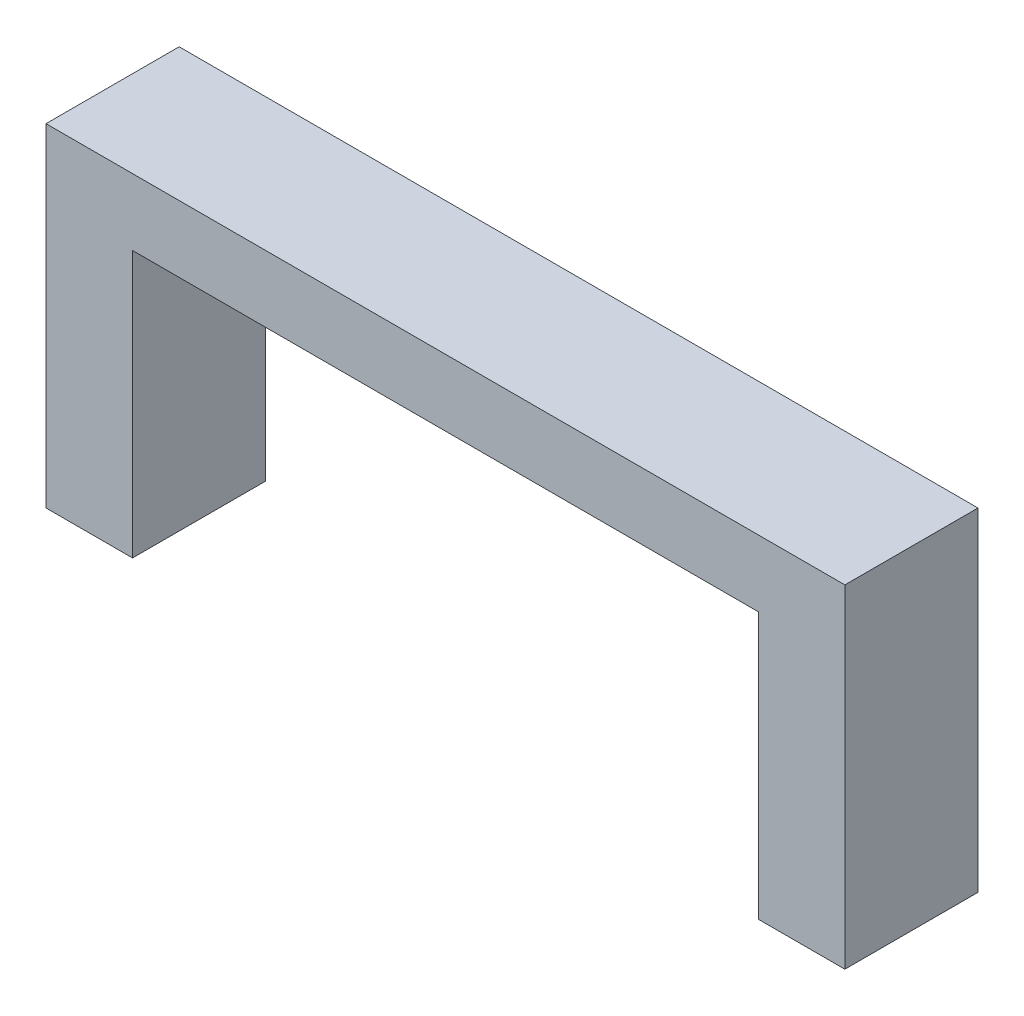
ISO-10303-21;
HEADER;
FILE_DESCRIPTION(('STEP AP214'),'2;1');
FILE_NAME('part.step','',(''),(''),'','','');
FILE_SCHEMA(('AUTOMOTIVE_DESIGN { 1 0 10303 214 1 1 1 1 }'));
ENDSEC;
DATA;
#1=APPLICATION_CONTEXT('core data for automotive mechanical design processes');
#2=APPLICATION_PROTOCOL_DEFINITION('international standard','automotive_design',2000,#1);
#3=PRODUCT_CONTEXT('',#1,'mechanical');
#4=PRODUCT('Part','Part','',(#3));
#5=PRODUCT_RELATED_PRODUCT_CATEGORY('part','',(#4));
#6=PRODUCT_DEFINITION_FORMATION('','',#4);
#7=PRODUCT_DEFINITION_CONTEXT('part definition',#1,'design');
#8=PRODUCT_DEFINITION('design','',#6,#7);
#9=PRODUCT_DEFINITION_SHAPE('','',#8);
#10=(LENGTH_UNIT() NAMED_UNIT(*) SI_UNIT(.MILLI.,.METRE.));
#11=(NAMED_UNIT(*) PLANE_ANGLE_UNIT() SI_UNIT($,.RADIAN.));
#12=(NAMED_UNIT(*) SI_UNIT($,.STERADIAN.) SOLID_ANGLE_UNIT());
#13=UNCERTAINTY_MEASURE_WITH_UNIT(LENGTH_MEASURE(1.E-05),#10,'distance_accuracy_value','');
#14=(GEOMETRIC_REPRESENTATION_CONTEXT(3) GLOBAL_UNCERTAINTY_ASSIGNED_CONTEXT((#13)) GLOBAL_UNIT_ASSIGNED_CONTEXT((#10,
#11,#12)) REPRESENTATION_CONTEXT('',''));
#15=CARTESIAN_POINT('',(0.,0.,0.));
#16=DIRECTION('',(0.,0.,1.));
#17=DIRECTION('',(1.,0.,0.));
#18=AXIS2_PLACEMENT_3D('',#15,#16,#17);
#19=CARTESIAN_POINT('',(-30.,-20.,10.));
#20=DIRECTION('',(1.,0.,0.));
#21=DIRECTION('',(0.,1.,0.));
#22=AXIS2_PLACEMENT_3D('',#19,#20,#21);
#23=PLANE('',#22);
#24=DIRECTION('',(0.,-1.,0.));
#25=VECTOR('',#24,1.);
#26=CARTESIAN_POINT('',(-30.,-20.,0.));
#27=LINE('',#26,#25);
#28=CARTESIAN_POINT('',(-30.,4.99999999999999,0.));
#29=VERTEX_POINT('',#28);
#30=CARTESIAN_POINT('',(-30.,-20.,0.));
#31=VERTEX_POINT('',#30);
#32=EDGE_CURVE('E140',#29,#31,#27,.T.);
#33=ORIENTED_EDGE('',*,*,#32,.T.);
#34=DIRECTION('',(0.,0.,-1.));
#35=VECTOR('',#34,1.);
#36=CARTESIAN_POINT('',(-30.,-20.,10.));
#37=LINE('',#36,#35);
#38=CARTESIAN_POINT('',(-30.,-20.,10.));
#39=VERTEX_POINT('',#38);
#40=EDGE_CURVE('E11',#39,#31,#37,.T.);
#41=ORIENTED_EDGE('',*,*,#40,.F.);
#42=DIRECTION('',(0.,-1.,0.));
#43=VECTOR('',#42,1.);
#44=CARTESIAN_POINT('',(-30.,-20.,10.));
#45=LINE('',#44,#43);
#46=CARTESIAN_POINT('',(-30.,4.99999999999999,10.));
#47=VERTEX_POINT('',#46);
#48=EDGE_CURVE('E162',#47,#39,#45,.T.);
#49=ORIENTED_EDGE('',*,*,#48,.F.);
#50=DIRECTION('',(0.,0.,-1.));
#51=VECTOR('',#50,1.);
#52=CARTESIAN_POINT('',(-30.,4.99999999999999,10.));
#53=LINE('',#52,#51);
#54=EDGE_CURVE('E136',#47,#29,#53,.T.);
#55=ORIENTED_EDGE('',*,*,#54,.T.);
#56=EDGE_LOOP('',(#33,#41,#49,#55));
#57=FACE_BOUND('',#56,.T.);
#58=ADVANCED_FACE('F39',(#57),#23,.F.);
#59=CARTESIAN_POINT('',(-23.5,-20.,10.));
#60=DIRECTION('',(0.,1.,0.));
#61=DIRECTION('',(-1.,0.,0.));
#62=AXIS2_PLACEMENT_3D('',#59,#60,#61);
#63=PLANE('',#62);
#64=DIRECTION('',(1.,0.,0.));
#65=VECTOR('',#64,1.);
#66=CARTESIAN_POINT('',(-23.5,-20.,0.));
#67=LINE('',#66,#65);
#68=CARTESIAN_POINT('',(-23.5,-20.,0.));
#69=VERTEX_POINT('',#68);
#70=EDGE_CURVE('E144',#31,#69,#67,.T.);
#71=ORIENTED_EDGE('',*,*,#70,.T.);
#72=DIRECTION('',(0.,0.,-1.));
#73=VECTOR('',#72,1.);
#74=CARTESIAN_POINT('',(-23.5,-20.,10.));
#75=LINE('',#74,#73);
#76=CARTESIAN_POINT('',(-23.5,-20.,10.));
#77=VERTEX_POINT('',#76);
#78=EDGE_CURVE('E48',#77,#69,#75,.T.);
#79=ORIENTED_EDGE('',*,*,#78,.F.);
#80=DIRECTION('',(1.,0.,0.));
#81=VECTOR('',#80,1.);
#82=CARTESIAN_POINT('',(-23.5,-20.,10.));
#83=LINE('',#82,#81);
#84=EDGE_CURVE('E99',#39,#77,#83,.T.);
#85=ORIENTED_EDGE('',*,*,#84,.F.);
#86=ORIENTED_EDGE('',*,*,#40,.T.);
#87=EDGE_LOOP('',(#71,#79,#85,#86));
#88=FACE_BOUND('',#87,.T.);
#89=ADVANCED_FACE('F208',(#88),#63,.F.);
#90=CARTESIAN_POINT('',(-23.5,0.,10.));
#91=DIRECTION('',(-1.,0.,0.));
#92=DIRECTION('',(0.,-1.,0.));
#93=AXIS2_PLACEMENT_3D('',#90,#91,#92);
#94=PLANE('',#93);
#95=DIRECTION('',(0.,1.,0.));
#96=VECTOR('',#95,1.);
#97=CARTESIAN_POINT('',(-23.5,0.,0.));
#98=LINE('',#97,#96);
#99=CARTESIAN_POINT('',(-23.5,0.,0.));
#100=VERTEX_POINT('',#99);
#101=EDGE_CURVE('E147',#69,#100,#98,.T.);
#102=ORIENTED_EDGE('',*,*,#101,.T.);
#103=DIRECTION('',(0.,0.,-1.));
#104=VECTOR('',#103,1.);
#105=CARTESIAN_POINT('',(-23.5,0.,10.));
#106=LINE('',#105,#104);
#107=CARTESIAN_POINT('',(-23.5,0.,10.));
#108=VERTEX_POINT('',#107);
#109=EDGE_CURVE('E173',#108,#100,#106,.T.);
#110=ORIENTED_EDGE('',*,*,#109,.F.);
#111=DIRECTION('',(0.,1.,0.));
#112=VECTOR('',#111,1.);
#113=CARTESIAN_POINT('',(-23.5,0.,10.));
#114=LINE('',#113,#112);
#115=EDGE_CURVE('E183',#77,#108,#114,.T.);
#116=ORIENTED_EDGE('',*,*,#115,.F.);
#117=ORIENTED_EDGE('',*,*,#78,.T.);
#118=EDGE_LOOP('',(#102,#110,#116,#117));
#119=FACE_BOUND('',#118,.T.);
#120=ADVANCED_FACE('F181',(#119),#94,.F.);
#121=CARTESIAN_POINT('',(23.5,0.,10.));
#122=DIRECTION('',(0.,1.,0.));
#123=DIRECTION('',(-1.,0.,0.));
#124=AXIS2_PLACEMENT_3D('',#121,#122,#123);
#125=PLANE('',#124);
#126=DIRECTION('',(1.,0.,0.));
#127=VECTOR('',#126,1.);
#128=CARTESIAN_POINT('',(23.5,0.,0.));
#129=LINE('',#128,#127);
#130=CARTESIAN_POINT('',(23.5,0.,0.));
#131=VERTEX_POINT('',#130);
#132=EDGE_CURVE('E150',#100,#131,#129,.T.);
#133=ORIENTED_EDGE('',*,*,#132,.T.);
#134=DIRECTION('',(0.,0.,-1.));
#135=VECTOR('',#134,1.);
#136=CARTESIAN_POINT('',(23.5,0.,10.));
#137=LINE('',#136,#135);
#138=CARTESIAN_POINT('',(23.5,0.,10.));
#139=VERTEX_POINT('',#138);
#140=EDGE_CURVE('E169',#139,#131,#137,.T.);
#141=ORIENTED_EDGE('',*,*,#140,.F.);
#142=DIRECTION('',(1.,0.,0.));
#143=VECTOR('',#142,1.);
#144=CARTESIAN_POINT('',(23.5,0.,10.));
#145=LINE('',#144,#143);
#146=EDGE_CURVE('E196',#108,#139,#145,.T.);
#147=ORIENTED_EDGE('',*,*,#146,.F.);
#148=ORIENTED_EDGE('',*,*,#109,.T.);
#149=EDGE_LOOP('',(#133,#141,#147,#148));
#150=FACE_BOUND('',#149,.T.);
#151=ADVANCED_FACE('F191',(#150),#125,.F.);
#152=CARTESIAN_POINT('',(23.5,-20.,10.));
#153=DIRECTION('',(1.,0.,0.));
#154=DIRECTION('',(0.,1.,0.));
#155=AXIS2_PLACEMENT_3D('',#152,#153,#154);
#156=PLANE('',#155);
#157=DIRECTION('',(0.,-1.,0.));
#158=VECTOR('',#157,1.);
#159=CARTESIAN_POINT('',(23.5,-20.,0.));
#160=LINE('',#159,#158);
#161=CARTESIAN_POINT('',(23.5,-20.,0.));
#162=VERTEX_POINT('',#161);
#163=EDGE_CURVE('E153',#131,#162,#160,.T.);
#164=ORIENTED_EDGE('',*,*,#163,.T.);
#165=DIRECTION('',(0.,0.,-1.));
#166=VECTOR('',#165,1.);
#167=CARTESIAN_POINT('',(23.5,-20.,10.));
#168=LINE('',#167,#166);
#169=CARTESIAN_POINT('',(23.5,-20.,10.));
#170=VERTEX_POINT('',#169);
#171=EDGE_CURVE('E129',#170,#162,#168,.T.);
#172=ORIENTED_EDGE('',*,*,#171,.F.);
#173=DIRECTION('',(0.,-1.,0.));
#174=VECTOR('',#173,1.);
#175=CARTESIAN_POINT('',(23.5,-20.,10.));
#176=LINE('',#175,#174);
#177=EDGE_CURVE('E118',#139,#170,#176,.T.);
#178=ORIENTED_EDGE('',*,*,#177,.F.);
#179=ORIENTED_EDGE('',*,*,#140,.T.);
#180=EDGE_LOOP('',(#164,#172,#178,#179));
#181=FACE_BOUND('',#180,.T.);
#182=ADVANCED_FACE('F194',(#181),#156,.F.);
#183=CARTESIAN_POINT('',(30.,-20.,10.));
#184=DIRECTION('',(0.,1.,0.));
#185=DIRECTION('',(-1.,0.,0.));
#186=AXIS2_PLACEMENT_3D('',#183,#184,#185);
#187=PLANE('',#186);
#188=DIRECTION('',(1.,0.,0.));
#189=VECTOR('',#188,1.);
#190=CARTESIAN_POINT('',(30.,-20.,0.));
#191=LINE('',#190,#189);
#192=CARTESIAN_POINT('',(30.,-20.,0.));
#193=VERTEX_POINT('',#192);
#194=EDGE_CURVE('E127',#162,#193,#191,.T.);
#195=ORIENTED_EDGE('',*,*,#194,.T.);
#196=DIRECTION('',(0.,0.,-1.));
#197=VECTOR('',#196,1.);
#198=CARTESIAN_POINT('',(30.,-20.,10.));
#199=LINE('',#198,#197);
#200=CARTESIAN_POINT('',(30.,-20.,10.));
#201=VERTEX_POINT('',#200);
#202=EDGE_CURVE('E124',#201,#193,#199,.T.);
#203=ORIENTED_EDGE('',*,*,#202,.F.);
#204=DIRECTION('',(1.,0.,0.));
#205=VECTOR('',#204,1.);
#206=CARTESIAN_POINT('',(30.,-20.,10.));
#207=LINE('',#206,#205);
#208=EDGE_CURVE('E112',#170,#201,#207,.T.);
#209=ORIENTED_EDGE('',*,*,#208,.F.);
#210=ORIENTED_EDGE('',*,*,#171,.T.);
#211=EDGE_LOOP('',(#195,#203,#209,#210));
#212=FACE_BOUND('',#211,.T.);
#213=ADVANCED_FACE('F125',(#212),#187,.F.);
#214=CARTESIAN_POINT('',(30.,5.00000000000001,10.));
#215=DIRECTION('',(-1.,0.,0.));
#216=DIRECTION('',(0.,-1.,0.));
#217=AXIS2_PLACEMENT_3D('',#214,#215,#216);
#218=PLANE('',#217);
#219=DIRECTION('',(0.,1.,0.));
#220=VECTOR('',#219,1.);
#221=CARTESIAN_POINT('',(30.,5.00000000000001,0.));
#222=LINE('',#221,#220);
#223=CARTESIAN_POINT('',(30.,5.00000000000001,0.));
#224=VERTEX_POINT('',#223);
#225=EDGE_CURVE('E85',#193,#224,#222,.T.);
#226=ORIENTED_EDGE('',*,*,#225,.T.);
#227=DIRECTION('',(0.,0.,-1.));
#228=VECTOR('',#227,1.);
#229=CARTESIAN_POINT('',(30.,5.00000000000001,10.));
#230=LINE('',#229,#228);
#231=CARTESIAN_POINT('',(30.,5.00000000000001,10.));
#232=VERTEX_POINT('',#231);
#233=EDGE_CURVE('E130',#232,#224,#230,.T.);
#234=ORIENTED_EDGE('',*,*,#233,.F.);
#235=DIRECTION('',(0.,1.,0.));
#236=VECTOR('',#235,1.);
#237=CARTESIAN_POINT('',(30.,5.00000000000001,10.));
#238=LINE('',#237,#236);
#239=EDGE_CURVE('E116',#201,#232,#238,.T.);
#240=ORIENTED_EDGE('',*,*,#239,.F.);
#241=ORIENTED_EDGE('',*,*,#202,.T.);
#242=EDGE_LOOP('',(#226,#234,#240,#241));
#243=FACE_BOUND('',#242,.T.);
#244=ADVANCED_FACE('F132',(#243),#218,.F.);
#245=CARTESIAN_POINT('',(-30.,4.99999999999999,10.));
#246=DIRECTION('',(0.,-1.,0.));
#247=DIRECTION('',(1.,0.,0.));
#248=AXIS2_PLACEMENT_3D('',#245,#246,#247);
#249=PLANE('',#248);
#250=DIRECTION('',(-1.,0.,0.));
#251=VECTOR('',#250,1.);
#252=CARTESIAN_POINT('',(-30.,4.99999999999999,0.));
#253=LINE('',#252,#251);
#254=EDGE_CURVE('E91',#224,#29,#253,.T.);
#255=ORIENTED_EDGE('',*,*,#254,.T.);
#256=ORIENTED_EDGE('',*,*,#54,.F.);
#257=DIRECTION('',(-1.,0.,0.));
#258=VECTOR('',#257,1.);
#259=CARTESIAN_POINT('',(-30.,4.99999999999999,10.));
#260=LINE('',#259,#258);
#261=EDGE_CURVE('E56',#232,#47,#260,.T.);
#262=ORIENTED_EDGE('',*,*,#261,.F.);
#263=ORIENTED_EDGE('',*,*,#233,.T.);
#264=EDGE_LOOP('',(#255,#256,#262,#263));
#265=FACE_BOUND('',#264,.T.);
#266=ADVANCED_FACE('F224',(#265),#249,.F.);
#267=CARTESIAN_POINT('',(0.,0.,10.));
#268=DIRECTION('',(0.,0.,-1.));
#269=DIRECTION('',(-1.,0.,0.));
#270=AXIS2_PLACEMENT_3D('',#267,#268,#269);
#271=PLANE('',#270);
#272=ORIENTED_EDGE('',*,*,#48,.T.);
#273=ORIENTED_EDGE('',*,*,#84,.T.);
#274=ORIENTED_EDGE('',*,*,#115,.T.);
#275=ORIENTED_EDGE('',*,*,#146,.T.);
#276=ORIENTED_EDGE('',*,*,#177,.T.);
#277=ORIENTED_EDGE('',*,*,#208,.T.);
#278=ORIENTED_EDGE('',*,*,#239,.T.);
#279=ORIENTED_EDGE('',*,*,#261,.T.);
#280=EDGE_LOOP('',(#272,#273,#274,#275,#276,#277,#278,#279));
#281=FACE_BOUND('',#280,.T.);
#282=ADVANCED_FACE('F114',(#281),#271,.F.);
#283=CARTESIAN_POINT('',(0.,0.,0.));
#284=DIRECTION('',(0.,0.,-1.));
#285=DIRECTION('',(-1.,0.,0.));
#286=AXIS2_PLACEMENT_3D('',#283,#284,#285);
#287=PLANE('',#286);
#288=ORIENTED_EDGE('',*,*,#32,.F.);
#289=ORIENTED_EDGE('',*,*,#254,.F.);
#290=ORIENTED_EDGE('',*,*,#225,.F.);
#291=ORIENTED_EDGE('',*,*,#194,.F.);
#292=ORIENTED_EDGE('',*,*,#163,.F.);
#293=ORIENTED_EDGE('',*,*,#132,.F.);
#294=ORIENTED_EDGE('',*,*,#101,.F.);
#295=ORIENTED_EDGE('',*,*,#70,.F.);
#296=EDGE_LOOP('',(#288,#289,#290,#291,#292,#293,#294,#295));
#297=FACE_BOUND('',#296,.T.);
#298=ADVANCED_FACE('F187',(#297),#287,.T.);
#299=CLOSED_SHELL('',(#58,#89,#120,#151,#182,#213,#244,#266,#282,#298));
#300=MANIFOLD_SOLID_BREP('B2',#299);
#301=ADVANCED_BREP_SHAPE_REPRESENTATION('',(#18,#300),#14);
#302=SHAPE_DEFINITION_REPRESENTATION(#9,#301);
ENDSEC;
END-ISO-10303-21;
